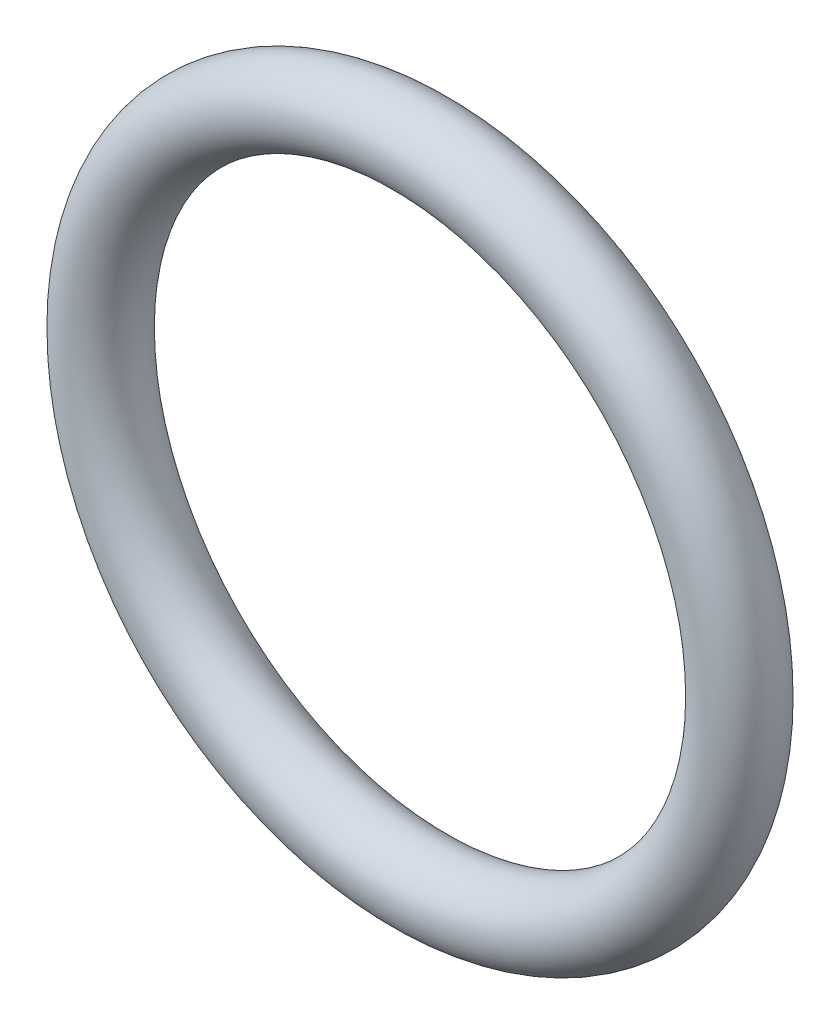
ISO-10303-21;
HEADER;
FILE_DESCRIPTION(('STEP AP214'),'2;1');
FILE_NAME('part.step','',(''),(''),'','','');
FILE_SCHEMA(('AUTOMOTIVE_DESIGN { 1 0 10303 214 1 1 1 1 }'));
ENDSEC;
DATA;
#1=APPLICATION_CONTEXT('core data for automotive mechanical design processes');
#2=APPLICATION_PROTOCOL_DEFINITION('international standard','automotive_design',2000,#1);
#3=PRODUCT_CONTEXT('',#1,'mechanical');
#4=PRODUCT('Part','Part','',(#3));
#5=PRODUCT_RELATED_PRODUCT_CATEGORY('part','',(#4));
#6=PRODUCT_DEFINITION_FORMATION('','',#4);
#7=PRODUCT_DEFINITION_CONTEXT('part definition',#1,'design');
#8=PRODUCT_DEFINITION('design','',#6,#7);
#9=PRODUCT_DEFINITION_SHAPE('','',#8);
#10=(LENGTH_UNIT() NAMED_UNIT(*) SI_UNIT(.MILLI.,.METRE.));
#11=(NAMED_UNIT(*) PLANE_ANGLE_UNIT() SI_UNIT($,.RADIAN.));
#12=(NAMED_UNIT(*) SI_UNIT($,.STERADIAN.) SOLID_ANGLE_UNIT());
#13=UNCERTAINTY_MEASURE_WITH_UNIT(LENGTH_MEASURE(1.E-05),#10,'distance_accuracy_value','');
#14=(GEOMETRIC_REPRESENTATION_CONTEXT(3) GLOBAL_UNCERTAINTY_ASSIGNED_CONTEXT((#13)) GLOBAL_UNIT_ASSIGNED_CONTEXT((#10,
#11,#12)) REPRESENTATION_CONTEXT('',''));
#15=CARTESIAN_POINT('',(0.,0.,0.));
#16=DIRECTION('',(0.,0.,1.));
#17=DIRECTION('',(1.,0.,0.));
#18=AXIS2_PLACEMENT_3D('',#15,#16,#17);
#19=CARTESIAN_POINT('',(0.,0.,0.));
#20=DIRECTION('',(0.,0.,1.));
#21=DIRECTION('',(1.,0.,0.));
#22=AXIS2_PLACEMENT_3D('',#19,#20,#21);
#23=TOROIDAL_SURFACE('',#22,9.2837,1.1049);
#24=CARTESIAN_POINT('',(10.3886,0.,0.));
#25=VERTEX_POINT('',#24);
#26=VERTEX_LOOP('',#25);
#27=FACE_BOUND('',#26,.T.);
#28=ADVANCED_FACE('F33',(#27),#23,.T.);
#29=CLOSED_SHELL('',(#28));
#30=MANIFOLD_SOLID_BREP('B2',#29);
#31=ADVANCED_BREP_SHAPE_REPRESENTATION('',(#18,#30),#14);
#32=SHAPE_DEFINITION_REPRESENTATION(#9,#31);
ENDSEC;
END-ISO-10303-21;
